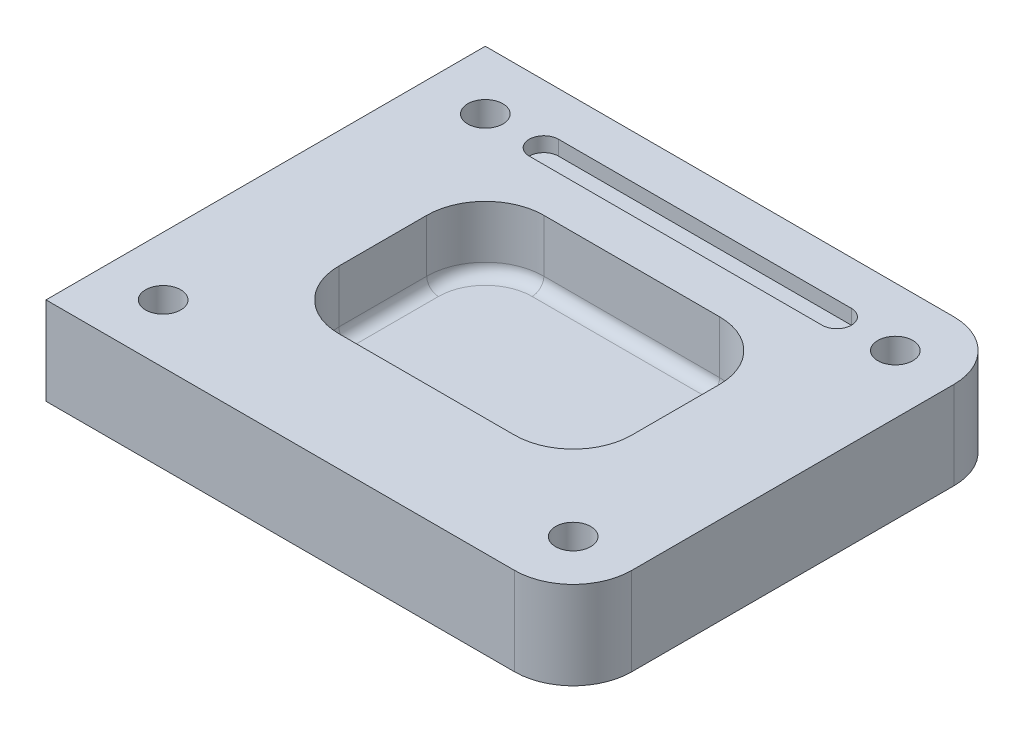
ISO-10303-21;
HEADER;
FILE_DESCRIPTION(('STEP AP214'),'2;1');
FILE_NAME('part.step','',(''),(''),'','','');
FILE_SCHEMA(('AUTOMOTIVE_DESIGN { 1 0 10303 214 1 1 1 1 }'));
ENDSEC;
DATA;
#1=APPLICATION_CONTEXT('core data for automotive mechanical design processes');
#2=APPLICATION_PROTOCOL_DEFINITION('international standard','automotive_design',2000,#1);
#3=PRODUCT_CONTEXT('',#1,'mechanical');
#4=PRODUCT('Part','Part','',(#3));
#5=PRODUCT_RELATED_PRODUCT_CATEGORY('part','',(#4));
#6=PRODUCT_DEFINITION_FORMATION('','',#4);
#7=PRODUCT_DEFINITION_CONTEXT('part definition',#1,'design');
#8=PRODUCT_DEFINITION('design','',#6,#7);
#9=PRODUCT_DEFINITION_SHAPE('','',#8);
#10=(LENGTH_UNIT() NAMED_UNIT(*) SI_UNIT(.MILLI.,.METRE.));
#11=(NAMED_UNIT(*) PLANE_ANGLE_UNIT() SI_UNIT($,.RADIAN.));
#12=(NAMED_UNIT(*) SI_UNIT($,.STERADIAN.) SOLID_ANGLE_UNIT());
#13=UNCERTAINTY_MEASURE_WITH_UNIT(LENGTH_MEASURE(1.E-05),#10,'distance_accuracy_value','');
#14=(GEOMETRIC_REPRESENTATION_CONTEXT(3) GLOBAL_UNCERTAINTY_ASSIGNED_CONTEXT((#13)) GLOBAL_UNIT_ASSIGNED_CONTEXT((#10,
#11,#12)) REPRESENTATION_CONTEXT('',''));
#15=CARTESIAN_POINT('',(0.,0.,0.));
#16=DIRECTION('',(0.,0.,1.));
#17=DIRECTION('',(1.,0.,0.));
#18=AXIS2_PLACEMENT_3D('',#15,#16,#17);
#19=CARTESIAN_POINT('',(90.,30.,75.));
#20=DIRECTION('',(-1.,0.,0.));
#21=DIRECTION('',(0.,0.,1.));
#22=AXIS2_PLACEMENT_3D('',#19,#20,#21);
#23=PLANE('',#22);
#24=DIRECTION('',(0.,0.,-1.));
#25=VECTOR('',#24,1.);
#26=CARTESIAN_POINT('',(90.,30.,75.));
#27=LINE('',#26,#25);
#28=CARTESIAN_POINT('',(90.,30.,55.));
#29=VERTEX_POINT('',#28);
#30=CARTESIAN_POINT('',(90.,30.,-55.));
#31=VERTEX_POINT('',#30);
#32=EDGE_CURVE('E309',#29,#31,#27,.T.);
#33=ORIENTED_EDGE('',*,*,#32,.F.);
#34=DIRECTION('',(0.,-1.,0.));
#35=VECTOR('',#34,1.);
#36=CARTESIAN_POINT('',(90.,30.,55.));
#37=LINE('',#36,#35);
#38=CARTESIAN_POINT('',(90.,0.,55.));
#39=VERTEX_POINT('',#38);
#40=EDGE_CURVE('E386',#29,#39,#37,.T.);
#41=ORIENTED_EDGE('',*,*,#40,.T.);
#42=DIRECTION('',(0.,0.,-1.));
#43=VECTOR('',#42,1.);
#44=CARTESIAN_POINT('',(90.,0.,75.));
#45=LINE('',#44,#43);
#46=CARTESIAN_POINT('',(90.,0.,-55.));
#47=VERTEX_POINT('',#46);
#48=EDGE_CURVE('E308',#39,#47,#45,.T.);
#49=ORIENTED_EDGE('',*,*,#48,.T.);
#50=DIRECTION('',(0.,-1.,0.));
#51=VECTOR('',#50,1.);
#52=CARTESIAN_POINT('',(90.,30.,-55.));
#53=LINE('',#52,#51);
#54=EDGE_CURVE('E383',#47,#31,#53,.F.);
#55=ORIENTED_EDGE('',*,*,#54,.T.);
#56=EDGE_LOOP('',(#33,#41,#49,#55));
#57=FACE_BOUND('',#56,.T.);
#58=ADVANCED_FACE('F43',(#57),#23,.F.);
#59=CARTESIAN_POINT('',(-90.,30.,-75.));
#60=DIRECTION('',(0.,0.,1.));
#61=DIRECTION('',(1.,0.,0.));
#62=AXIS2_PLACEMENT_3D('',#59,#60,#61);
#63=PLANE('',#62);
#64=DIRECTION('',(-1.,0.,0.));
#65=VECTOR('',#64,1.);
#66=CARTESIAN_POINT('',(-90.,30.,-75.));
#67=LINE('',#66,#65);
#68=CARTESIAN_POINT('',(70.,30.,-75.));
#69=VERTEX_POINT('',#68);
#70=CARTESIAN_POINT('',(-90.,30.,-75.));
#71=VERTEX_POINT('',#70);
#72=EDGE_CURVE('E313',#69,#71,#67,.T.);
#73=ORIENTED_EDGE('',*,*,#72,.F.);
#74=DIRECTION('',(0.,-1.,0.));
#75=VECTOR('',#74,1.);
#76=CARTESIAN_POINT('',(70.,30.,-75.));
#77=LINE('',#76,#75);
#78=CARTESIAN_POINT('',(70.,0.,-75.));
#79=VERTEX_POINT('',#78);
#80=EDGE_CURVE('E405',#69,#79,#77,.T.);
#81=ORIENTED_EDGE('',*,*,#80,.T.);
#82=DIRECTION('',(-1.,0.,0.));
#83=VECTOR('',#82,1.);
#84=CARTESIAN_POINT('',(-90.,0.,-75.));
#85=LINE('',#84,#83);
#86=CARTESIAN_POINT('',(-90.,0.,-75.));
#87=VERTEX_POINT('',#86);
#88=EDGE_CURVE('E328',#79,#87,#85,.T.);
#89=ORIENTED_EDGE('',*,*,#88,.T.);
#90=DIRECTION('',(0.,-1.,0.));
#91=VECTOR('',#90,1.);
#92=CARTESIAN_POINT('',(-90.,30.,-75.));
#93=LINE('',#92,#91);
#94=EDGE_CURVE('E340',#71,#87,#93,.T.);
#95=ORIENTED_EDGE('',*,*,#94,.F.);
#96=EDGE_LOOP('',(#73,#81,#89,#95));
#97=FACE_BOUND('',#96,.T.);
#98=ADVANCED_FACE('F560',(#97),#63,.F.);
#99=CARTESIAN_POINT('',(-90.,30.,75.));
#100=DIRECTION('',(1.,0.,0.));
#101=DIRECTION('',(0.,0.,-1.));
#102=AXIS2_PLACEMENT_3D('',#99,#100,#101);
#103=PLANE('',#102);
#104=DIRECTION('',(0.,0.,1.));
#105=VECTOR('',#104,1.);
#106=CARTESIAN_POINT('',(-90.,0.,75.));
#107=LINE('',#106,#105);
#108=CARTESIAN_POINT('',(-90.,0.,75.));
#109=VERTEX_POINT('',#108);
#110=EDGE_CURVE('E331',#87,#109,#107,.T.);
#111=ORIENTED_EDGE('',*,*,#110,.T.);
#112=DIRECTION('',(0.,-1.,0.));
#113=VECTOR('',#112,1.);
#114=CARTESIAN_POINT('',(-90.,30.,75.));
#115=LINE('',#114,#113);
#116=CARTESIAN_POINT('',(-90.,30.,75.));
#117=VERTEX_POINT('',#116);
#118=EDGE_CURVE('E324',#117,#109,#115,.T.);
#119=ORIENTED_EDGE('',*,*,#118,.F.);
#120=DIRECTION('',(0.,0.,1.));
#121=VECTOR('',#120,1.);
#122=CARTESIAN_POINT('',(-90.,30.,75.));
#123=LINE('',#122,#121);
#124=EDGE_CURVE('E317',#71,#117,#123,.T.);
#125=ORIENTED_EDGE('',*,*,#124,.F.);
#126=ORIENTED_EDGE('',*,*,#94,.T.);
#127=EDGE_LOOP('',(#111,#119,#125,#126));
#128=FACE_BOUND('',#127,.T.);
#129=ADVANCED_FACE('F566',(#128),#103,.F.);
#130=CARTESIAN_POINT('',(-90.,30.,75.));
#131=DIRECTION('',(0.,0.,-1.));
#132=DIRECTION('',(-1.,0.,0.));
#133=AXIS2_PLACEMENT_3D('',#130,#131,#132);
#134=PLANE('',#133);
#135=DIRECTION('',(1.,0.,0.));
#136=VECTOR('',#135,1.);
#137=CARTESIAN_POINT('',(-90.,0.,75.));
#138=LINE('',#137,#136);
#139=CARTESIAN_POINT('',(70.,0.,75.));
#140=VERTEX_POINT('',#139);
#141=EDGE_CURVE('E314',#109,#140,#138,.T.);
#142=ORIENTED_EDGE('',*,*,#141,.T.);
#143=DIRECTION('',(0.,-1.,0.));
#144=VECTOR('',#143,1.);
#145=CARTESIAN_POINT('',(70.,30.,75.));
#146=LINE('',#145,#144);
#147=CARTESIAN_POINT('',(70.,30.,75.));
#148=VERTEX_POINT('',#147);
#149=EDGE_CURVE('E396',#140,#148,#146,.F.);
#150=ORIENTED_EDGE('',*,*,#149,.T.);
#151=DIRECTION('',(1.,0.,0.));
#152=VECTOR('',#151,1.);
#153=CARTESIAN_POINT('',(-90.,30.,75.));
#154=LINE('',#153,#152);
#155=EDGE_CURVE('E320',#117,#148,#154,.T.);
#156=ORIENTED_EDGE('',*,*,#155,.F.);
#157=ORIENTED_EDGE('',*,*,#118,.T.);
#158=EDGE_LOOP('',(#142,#150,#156,#157));
#159=FACE_BOUND('',#158,.T.);
#160=ADVANCED_FACE('F767',(#159),#134,.F.);
#161=CARTESIAN_POINT('',(0.,30.,0.));
#162=DIRECTION('',(0.,-1.,0.));
#163=DIRECTION('',(0.,0.,-1.));
#164=AXIS2_PLACEMENT_3D('',#161,#162,#163);
#165=PLANE('',#164);
#166=DIRECTION('',(1.,0.,0.));
#167=VECTOR('',#166,1.);
#168=CARTESIAN_POINT('',(-50.,30.,-50.));
#169=LINE('',#168,#167);
#170=CARTESIAN_POINT('',(-50.,30.,-50.));
#171=VERTEX_POINT('',#170);
#172=CARTESIAN_POINT('',(50.,30.,-50.));
#173=VERTEX_POINT('',#172);
#174=EDGE_CURVE('E246',#171,#173,#169,.T.);
#175=ORIENTED_EDGE('',*,*,#174,.F.);
#176=CARTESIAN_POINT('',(-50.,30.,-55.));
#177=DIRECTION('',(0.,1.,0.));
#178=DIRECTION('',(0.,0.,1.));
#179=AXIS2_PLACEMENT_3D('',#176,#177,#178);
#180=CIRCLE('',#179,5.);
#181=CARTESIAN_POINT('',(-50.,30.,-60.));
#182=VERTEX_POINT('',#181);
#183=EDGE_CURVE('E213',#182,#171,#180,.T.);
#184=ORIENTED_EDGE('',*,*,#183,.F.);
#185=DIRECTION('',(-1.,0.,0.));
#186=VECTOR('',#185,1.);
#187=CARTESIAN_POINT('',(-50.,30.,-60.));
#188=LINE('',#187,#186);
#189=CARTESIAN_POINT('',(50.,30.,-60.));
#190=VERTEX_POINT('',#189);
#191=EDGE_CURVE('E233',#190,#182,#188,.T.);
#192=ORIENTED_EDGE('',*,*,#191,.F.);
#193=CARTESIAN_POINT('',(50.,30.,-55.));
#194=DIRECTION('',(0.,1.,0.));
#195=DIRECTION('',(0.,0.,1.));
#196=AXIS2_PLACEMENT_3D('',#193,#194,#195);
#197=CIRCLE('',#196,5.);
#198=EDGE_CURVE('E237',#173,#190,#197,.T.);
#199=ORIENTED_EDGE('',*,*,#198,.F.);
#200=EDGE_LOOP('',(#175,#184,#192,#199));
#201=FACE_BOUND('',#200,.T.);
#202=DIRECTION('',(-1.,0.,0.));
#203=VECTOR('',#202,1.);
#204=CARTESIAN_POINT('',(50.,30.,-35.));
#205=LINE('',#204,#203);
#206=CARTESIAN_POINT('',(30.,30.,-35.));
#207=VERTEX_POINT('',#206);
#208=CARTESIAN_POINT('',(-29.9999999999999,30.,-35.));
#209=VERTEX_POINT('',#208);
#210=EDGE_CURVE('E266',#207,#209,#205,.T.);
#211=ORIENTED_EDGE('',*,*,#210,.F.);
#212=CARTESIAN_POINT('',(30.,30.,-15.));
#213=DIRECTION('',(0.,-1.,0.));
#214=DIRECTION('',(0.,0.,-1.));
#215=AXIS2_PLACEMENT_3D('',#212,#213,#214);
#216=CIRCLE('',#215,20.);
#217=CARTESIAN_POINT('',(50.,30.,-15.));
#218=VERTEX_POINT('',#217);
#219=EDGE_CURVE('E377',#207,#218,#216,.T.);
#220=ORIENTED_EDGE('',*,*,#219,.T.);
#221=DIRECTION('',(0.,0.,-1.));
#222=VECTOR('',#221,1.);
#223=CARTESIAN_POINT('',(50.,30.,35.));
#224=LINE('',#223,#222);
#225=CARTESIAN_POINT('',(50.,30.,15.));
#226=VERTEX_POINT('',#225);
#227=EDGE_CURVE('E270',#226,#218,#224,.T.);
#228=ORIENTED_EDGE('',*,*,#227,.F.);
#229=CARTESIAN_POINT('',(30.,30.,15.));
#230=DIRECTION('',(0.,-1.,0.));
#231=DIRECTION('',(0.,0.,-1.));
#232=AXIS2_PLACEMENT_3D('',#229,#230,#231);
#233=CIRCLE('',#232,20.);
#234=CARTESIAN_POINT('',(30.,30.,35.));
#235=VERTEX_POINT('',#234);
#236=EDGE_CURVE('E371',#226,#235,#233,.T.);
#237=ORIENTED_EDGE('',*,*,#236,.T.);
#238=DIRECTION('',(1.,0.,0.));
#239=VECTOR('',#238,1.);
#240=CARTESIAN_POINT('',(-50.,30.,35.));
#241=LINE('',#240,#239);
#242=CARTESIAN_POINT('',(-30.,30.,35.));
#243=VERTEX_POINT('',#242);
#244=EDGE_CURVE('E255',#243,#235,#241,.T.);
#245=ORIENTED_EDGE('',*,*,#244,.F.);
#246=CARTESIAN_POINT('',(-30.,30.,15.));
#247=DIRECTION('',(0.,-1.,0.));
#248=DIRECTION('',(0.,0.,-1.));
#249=AXIS2_PLACEMENT_3D('',#246,#247,#248);
#250=CIRCLE('',#249,20.);
#251=CARTESIAN_POINT('',(-50.,30.,15.));
#252=VERTEX_POINT('',#251);
#253=EDGE_CURVE('E374',#243,#252,#250,.T.);
#254=ORIENTED_EDGE('',*,*,#253,.T.);
#255=DIRECTION('',(0.,0.,1.));
#256=VECTOR('',#255,1.);
#257=CARTESIAN_POINT('',(-50.,30.,-35.));
#258=LINE('',#257,#256);
#259=CARTESIAN_POINT('',(-50.,30.,-15.));
#260=VERTEX_POINT('',#259);
#261=EDGE_CURVE('E261',#260,#252,#258,.T.);
#262=ORIENTED_EDGE('',*,*,#261,.F.);
#263=CARTESIAN_POINT('',(-30.,30.,-15.));
#264=DIRECTION('',(0.,-1.,0.));
#265=DIRECTION('',(0.,0.,-1.));
#266=AXIS2_PLACEMENT_3D('',#263,#264,#265);
#267=CIRCLE('',#266,20.);
#268=EDGE_CURVE('E380',#260,#209,#267,.T.);
#269=ORIENTED_EDGE('',*,*,#268,.T.);
#270=EDGE_LOOP('',(#211,#220,#228,#237,#245,#254,#262,#269));
#271=FACE_BOUND('',#270,.T.);
#272=CARTESIAN_POINT('',(-70.,30.,55.));
#273=DIRECTION('',(0.,1.,0.));
#274=DIRECTION('',(0.,0.,1.));
#275=AXIS2_PLACEMENT_3D('',#272,#273,#274);
#276=CIRCLE('',#275,5.99999999999999);
#277=CARTESIAN_POINT('',(-70.,30.,61.));
#278=VERTEX_POINT('',#277);
#279=EDGE_CURVE('E265',#278,#278,#276,.T.);
#280=ORIENTED_EDGE('',*,*,#279,.F.);
#281=EDGE_LOOP('',(#280));
#282=FACE_BOUND('',#281,.T.);
#283=CARTESIAN_POINT('',(-70.,30.,-55.));
#284=DIRECTION('',(0.,1.,0.));
#285=DIRECTION('',(0.,0.,1.));
#286=AXIS2_PLACEMENT_3D('',#283,#284,#285);
#287=CIRCLE('',#286,5.99999999999999);
#288=CARTESIAN_POINT('',(-70.,30.,-49.));
#289=VERTEX_POINT('',#288);
#290=EDGE_CURVE('E284',#289,#289,#287,.T.);
#291=ORIENTED_EDGE('',*,*,#290,.F.);
#292=EDGE_LOOP('',(#291));
#293=FACE_BOUND('',#292,.T.);
#294=CARTESIAN_POINT('',(70.,30.,-55.));
#295=DIRECTION('',(0.,1.,0.));
#296=DIRECTION('',(0.,0.,1.));
#297=AXIS2_PLACEMENT_3D('',#294,#295,#296);
#298=CIRCLE('',#297,5.99999999999999);
#299=CARTESIAN_POINT('',(70.,30.,-49.));
#300=VERTEX_POINT('',#299);
#301=EDGE_CURVE('E292',#300,#300,#298,.T.);
#302=ORIENTED_EDGE('',*,*,#301,.F.);
#303=EDGE_LOOP('',(#302));
#304=FACE_BOUND('',#303,.T.);
#305=CARTESIAN_POINT('',(70.,30.,55.));
#306=DIRECTION('',(0.,1.,0.));
#307=DIRECTION('',(0.,0.,1.));
#308=AXIS2_PLACEMENT_3D('',#305,#306,#307);
#309=CIRCLE('',#308,5.99999999999999);
#310=CARTESIAN_POINT('',(70.,30.,61.));
#311=VERTEX_POINT('',#310);
#312=EDGE_CURVE('E300',#311,#311,#309,.T.);
#313=ORIENTED_EDGE('',*,*,#312,.F.);
#314=EDGE_LOOP('',(#313));
#315=FACE_BOUND('',#314,.T.);
#316=ORIENTED_EDGE('',*,*,#155,.T.);
#317=CARTESIAN_POINT('',(70.,30.,55.));
#318=DIRECTION('',(0.,-1.,0.));
#319=DIRECTION('',(0.,0.,-1.));
#320=AXIS2_PLACEMENT_3D('',#317,#318,#319);
#321=CIRCLE('',#320,20.);
#322=EDGE_CURVE('E402',#148,#29,#321,.F.);
#323=ORIENTED_EDGE('',*,*,#322,.T.);
#324=ORIENTED_EDGE('',*,*,#32,.T.);
#325=CARTESIAN_POINT('',(70.,30.,-55.));
#326=DIRECTION('',(0.,-1.,0.));
#327=DIRECTION('',(0.,0.,-1.));
#328=AXIS2_PLACEMENT_3D('',#325,#326,#327);
#329=CIRCLE('',#328,20.);
#330=EDGE_CURVE('E399',#31,#69,#329,.F.);
#331=ORIENTED_EDGE('',*,*,#330,.T.);
#332=ORIENTED_EDGE('',*,*,#72,.T.);
#333=ORIENTED_EDGE('',*,*,#124,.T.);
#334=EDGE_LOOP('',(#316,#323,#324,#331,#332,#333));
#335=FACE_BOUND('',#334,.T.);
#336=ADVANCED_FACE('F506',(#201,#271,#282,#293,#304,#315,#335),#165,.F.);
#337=CARTESIAN_POINT('',(0.,0.,0.));
#338=DIRECTION('',(0.,-1.,0.));
#339=DIRECTION('',(0.,0.,-1.));
#340=AXIS2_PLACEMENT_3D('',#337,#338,#339);
#341=PLANE('',#340);
#342=ORIENTED_EDGE('',*,*,#48,.F.);
#343=CARTESIAN_POINT('',(70.,0.,55.));
#344=DIRECTION('',(0.,-1.,0.));
#345=DIRECTION('',(0.,0.,-1.));
#346=AXIS2_PLACEMENT_3D('',#343,#344,#345);
#347=CIRCLE('',#346,20.);
#348=EDGE_CURVE('E393',#39,#140,#347,.T.);
#349=ORIENTED_EDGE('',*,*,#348,.T.);
#350=ORIENTED_EDGE('',*,*,#141,.F.);
#351=ORIENTED_EDGE('',*,*,#110,.F.);
#352=ORIENTED_EDGE('',*,*,#88,.F.);
#353=CARTESIAN_POINT('',(70.,0.,-55.));
#354=DIRECTION('',(0.,-1.,0.));
#355=DIRECTION('',(0.,0.,-1.));
#356=AXIS2_PLACEMENT_3D('',#353,#354,#355);
#357=CIRCLE('',#356,20.);
#358=EDGE_CURVE('E390',#79,#47,#357,.T.);
#359=ORIENTED_EDGE('',*,*,#358,.T.);
#360=EDGE_LOOP('',(#342,#349,#350,#351,#352,#359));
#361=FACE_BOUND('',#360,.T.);
#362=ADVANCED_FACE('F756',(#361),#341,.T.);
#363=CARTESIAN_POINT('',(70.,20.,55.));
#364=DIRECTION('',(0.,1.,0.));
#365=DIRECTION('',(0.,0.,1.));
#366=AXIS2_PLACEMENT_3D('',#363,#364,#365);
#367=CONICAL_SURFACE('',#366,5.99999999999999,1.02974425867665);
#368=CARTESIAN_POINT('',(70.,16.3948362858346,55.));
#369=VERTEX_POINT('',#368);
#370=VERTEX_LOOP('',#369);
#371=FACE_BOUND('',#370,.T.);
#372=CARTESIAN_POINT('',(70.,20.,55.));
#373=DIRECTION('',(0.,1.,0.));
#374=DIRECTION('',(0.,0.,1.));
#375=AXIS2_PLACEMENT_3D('',#372,#373,#374);
#376=CIRCLE('',#375,5.99999999999999);
#377=CARTESIAN_POINT('',(70.,20.,61.));
#378=VERTEX_POINT('',#377);
#379=EDGE_CURVE('E304',#378,#378,#376,.T.);
#380=ORIENTED_EDGE('',*,*,#379,.T.);
#381=EDGE_LOOP('',(#380));
#382=FACE_BOUND('',#381,.T.);
#383=ADVANCED_FACE('F779',(#371,#382),#367,.F.);
#384=CARTESIAN_POINT('',(70.,30.,55.));
#385=DIRECTION('',(0.,1.,0.));
#386=DIRECTION('',(0.,0.,1.));
#387=AXIS2_PLACEMENT_3D('',#384,#385,#386);
#388=CYLINDRICAL_SURFACE('',#387,5.99999999999999);
#389=ORIENTED_EDGE('',*,*,#379,.F.);
#390=EDGE_LOOP('',(#389));
#391=FACE_BOUND('',#390,.T.);
#392=ORIENTED_EDGE('',*,*,#312,.T.);
#393=EDGE_LOOP('',(#392));
#394=FACE_BOUND('',#393,.T.);
#395=ADVANCED_FACE('F785',(#391,#394),#388,.F.);
#396=CARTESIAN_POINT('',(70.,20.,-55.));
#397=DIRECTION('',(0.,1.,0.));
#398=DIRECTION('',(0.,0.,1.));
#399=AXIS2_PLACEMENT_3D('',#396,#397,#398);
#400=CONICAL_SURFACE('',#399,5.99999999999999,1.02974425867665);
#401=CARTESIAN_POINT('',(70.,16.3948362858346,-55.));
#402=VERTEX_POINT('',#401);
#403=VERTEX_LOOP('',#402);
#404=FACE_BOUND('',#403,.T.);
#405=CARTESIAN_POINT('',(70.,20.,-55.));
#406=DIRECTION('',(0.,1.,0.));
#407=DIRECTION('',(0.,0.,1.));
#408=AXIS2_PLACEMENT_3D('',#405,#406,#407);
#409=CIRCLE('',#408,5.99999999999999);
#410=CARTESIAN_POINT('',(70.,20.,-49.));
#411=VERTEX_POINT('',#410);
#412=EDGE_CURVE('E296',#411,#411,#409,.T.);
#413=ORIENTED_EDGE('',*,*,#412,.T.);
#414=EDGE_LOOP('',(#413));
#415=FACE_BOUND('',#414,.T.);
#416=ADVANCED_FACE('F794',(#404,#415),#400,.F.);
#417=CARTESIAN_POINT('',(70.,30.,-55.));
#418=DIRECTION('',(0.,1.,0.));
#419=DIRECTION('',(0.,0.,1.));
#420=AXIS2_PLACEMENT_3D('',#417,#418,#419);
#421=CYLINDRICAL_SURFACE('',#420,5.99999999999999);
#422=ORIENTED_EDGE('',*,*,#412,.F.);
#423=EDGE_LOOP('',(#422));
#424=FACE_BOUND('',#423,.T.);
#425=ORIENTED_EDGE('',*,*,#301,.T.);
#426=EDGE_LOOP('',(#425));
#427=FACE_BOUND('',#426,.T.);
#428=ADVANCED_FACE('F803',(#424,#427),#421,.F.);
#429=CARTESIAN_POINT('',(-70.,20.,-55.));
#430=DIRECTION('',(0.,1.,0.));
#431=DIRECTION('',(0.,0.,1.));
#432=AXIS2_PLACEMENT_3D('',#429,#430,#431);
#433=CONICAL_SURFACE('',#432,5.99999999999999,1.02974425867665);
#434=CARTESIAN_POINT('',(-70.,16.3948362858346,-55.));
#435=VERTEX_POINT('',#434);
#436=VERTEX_LOOP('',#435);
#437=FACE_BOUND('',#436,.T.);
#438=CARTESIAN_POINT('',(-70.,20.,-55.));
#439=DIRECTION('',(0.,1.,0.));
#440=DIRECTION('',(0.,0.,1.));
#441=AXIS2_PLACEMENT_3D('',#438,#439,#440);
#442=CIRCLE('',#441,5.99999999999999);
#443=CARTESIAN_POINT('',(-70.,20.,-49.));
#444=VERTEX_POINT('',#443);
#445=EDGE_CURVE('E288',#444,#444,#442,.T.);
#446=ORIENTED_EDGE('',*,*,#445,.T.);
#447=EDGE_LOOP('',(#446));
#448=FACE_BOUND('',#447,.T.);
#449=ADVANCED_FACE('F811',(#437,#448),#433,.F.);
#450=CARTESIAN_POINT('',(-70.,30.,-55.));
#451=DIRECTION('',(0.,1.,0.));
#452=DIRECTION('',(0.,0.,1.));
#453=AXIS2_PLACEMENT_3D('',#450,#451,#452);
#454=CYLINDRICAL_SURFACE('',#453,5.99999999999999);
#455=ORIENTED_EDGE('',*,*,#445,.F.);
#456=EDGE_LOOP('',(#455));
#457=FACE_BOUND('',#456,.T.);
#458=ORIENTED_EDGE('',*,*,#290,.T.);
#459=EDGE_LOOP('',(#458));
#460=FACE_BOUND('',#459,.T.);
#461=ADVANCED_FACE('F818',(#457,#460),#454,.F.);
#462=CARTESIAN_POINT('',(-70.,20.,55.));
#463=DIRECTION('',(0.,1.,0.));
#464=DIRECTION('',(0.,0.,1.));
#465=AXIS2_PLACEMENT_3D('',#462,#463,#464);
#466=CONICAL_SURFACE('',#465,5.99999999999999,1.02974425867665);
#467=CARTESIAN_POINT('',(-70.,16.3948362858346,55.));
#468=VERTEX_POINT('',#467);
#469=VERTEX_LOOP('',#468);
#470=FACE_BOUND('',#469,.T.);
#471=CARTESIAN_POINT('',(-70.,20.,55.));
#472=DIRECTION('',(0.,1.,0.));
#473=DIRECTION('',(0.,0.,1.));
#474=AXIS2_PLACEMENT_3D('',#471,#472,#473);
#475=CIRCLE('',#474,5.99999999999999);
#476=CARTESIAN_POINT('',(-70.,20.,61.));
#477=VERTEX_POINT('',#476);
#478=EDGE_CURVE('E280',#477,#477,#475,.T.);
#479=ORIENTED_EDGE('',*,*,#478,.T.);
#480=EDGE_LOOP('',(#479));
#481=FACE_BOUND('',#480,.T.);
#482=ADVANCED_FACE('F826',(#470,#481),#466,.F.);
#483=CARTESIAN_POINT('',(-70.,30.,55.));
#484=DIRECTION('',(0.,1.,0.));
#485=DIRECTION('',(0.,0.,1.));
#486=AXIS2_PLACEMENT_3D('',#483,#484,#485);
#487=CYLINDRICAL_SURFACE('',#486,5.99999999999999);
#488=ORIENTED_EDGE('',*,*,#478,.F.);
#489=EDGE_LOOP('',(#488));
#490=FACE_BOUND('',#489,.T.);
#491=ORIENTED_EDGE('',*,*,#279,.T.);
#492=EDGE_LOOP('',(#491));
#493=FACE_BOUND('',#492,.T.);
#494=ADVANCED_FACE('F649',(#490,#493),#487,.F.);
#495=CARTESIAN_POINT('',(0.,8.,0.));
#496=DIRECTION('',(0.,-1.,0.));
#497=DIRECTION('',(0.,0.,-1.));
#498=AXIS2_PLACEMENT_3D('',#495,#496,#497);
#499=PLANE('',#498);
#500=CARTESIAN_POINT('',(-30.,8.,-15.));
#501=DIRECTION('',(0.,-1.,0.));
#502=DIRECTION('',(0.,0.,-1.));
#503=AXIS2_PLACEMENT_3D('',#500,#501,#502);
#504=CIRCLE('',#503,16.);
#505=CARTESIAN_POINT('',(-30.,8.,-31.));
#506=VERTEX_POINT('',#505);
#507=CARTESIAN_POINT('',(-46.,8.,-15.));
#508=VERTEX_POINT('',#507);
#509=EDGE_CURVE('E409',#506,#508,#504,.F.);
#510=ORIENTED_EDGE('',*,*,#509,.T.);
#511=DIRECTION('',(0.,0.,1.));
#512=VECTOR('',#511,1.);
#513=CARTESIAN_POINT('',(-46.,8.,15.));
#514=LINE('',#513,#512);
#515=CARTESIAN_POINT('',(-46.,8.,15.));
#516=VERTEX_POINT('',#515);
#517=EDGE_CURVE('E430',#508,#516,#514,.T.);
#518=ORIENTED_EDGE('',*,*,#517,.T.);
#519=CARTESIAN_POINT('',(-30.,8.,15.));
#520=DIRECTION('',(0.,-1.,0.));
#521=DIRECTION('',(0.,0.,-1.));
#522=AXIS2_PLACEMENT_3D('',#519,#520,#521);
#523=CIRCLE('',#522,16.);
#524=CARTESIAN_POINT('',(-30.,8.,31.));
#525=VERTEX_POINT('',#524);
#526=EDGE_CURVE('E427',#516,#525,#523,.F.);
#527=ORIENTED_EDGE('',*,*,#526,.T.);
#528=DIRECTION('',(1.,0.,0.));
#529=VECTOR('',#528,1.);
#530=CARTESIAN_POINT('',(30.,8.,31.));
#531=LINE('',#530,#529);
#532=CARTESIAN_POINT('',(30.,8.,31.));
#533=VERTEX_POINT('',#532);
#534=EDGE_CURVE('E424',#525,#533,#531,.T.);
#535=ORIENTED_EDGE('',*,*,#534,.T.);
#536=CARTESIAN_POINT('',(30.,8.,15.));
#537=DIRECTION('',(0.,-1.,0.));
#538=DIRECTION('',(0.,0.,-1.));
#539=AXIS2_PLACEMENT_3D('',#536,#537,#538);
#540=CIRCLE('',#539,16.);
#541=CARTESIAN_POINT('',(46.,8.,15.));
#542=VERTEX_POINT('',#541);
#543=EDGE_CURVE('E421',#533,#542,#540,.F.);
#544=ORIENTED_EDGE('',*,*,#543,.T.);
#545=DIRECTION('',(0.,0.,-1.));
#546=VECTOR('',#545,1.);
#547=CARTESIAN_POINT('',(46.,8.,-15.));
#548=LINE('',#547,#546);
#549=CARTESIAN_POINT('',(46.,8.,-15.));
#550=VERTEX_POINT('',#549);
#551=EDGE_CURVE('E418',#542,#550,#548,.T.);
#552=ORIENTED_EDGE('',*,*,#551,.T.);
#553=CARTESIAN_POINT('',(30.,8.,-15.));
#554=DIRECTION('',(0.,-1.,0.));
#555=DIRECTION('',(0.,0.,-1.));
#556=AXIS2_PLACEMENT_3D('',#553,#554,#555);
#557=CIRCLE('',#556,16.);
#558=CARTESIAN_POINT('',(30.,8.,-31.));
#559=VERTEX_POINT('',#558);
#560=EDGE_CURVE('E415',#550,#559,#557,.F.);
#561=ORIENTED_EDGE('',*,*,#560,.T.);
#562=DIRECTION('',(-1.,0.,0.));
#563=VECTOR('',#562,1.);
#564=CARTESIAN_POINT('',(-30.,8.,-31.));
#565=LINE('',#564,#563);
#566=EDGE_CURVE('E412',#559,#506,#565,.T.);
#567=ORIENTED_EDGE('',*,*,#566,.T.);
#568=EDGE_LOOP('',(#510,#518,#527,#535,#544,#552,#561,#567));
#569=FACE_BOUND('',#568,.T.);
#570=ADVANCED_FACE('F541',(#569),#499,.F.);
#571=CARTESIAN_POINT('',(50.,-122.065556157337,35.));
#572=DIRECTION('',(1.,0.,0.));
#573=DIRECTION('',(0.,0.,-1.));
#574=AXIS2_PLACEMENT_3D('',#571,#572,#573);
#575=PLANE('',#574);
#576=DIRECTION('',(0.,1.,0.));
#577=VECTOR('',#576,1.);
#578=CARTESIAN_POINT('',(50.,8.00000000000001,-15.));
#579=LINE('',#578,#577);
#580=CARTESIAN_POINT('',(50.,12.,-15.));
#581=VERTEX_POINT('',#580);
#582=EDGE_CURVE('E344',#218,#581,#579,.F.);
#583=ORIENTED_EDGE('',*,*,#582,.T.);
#584=DIRECTION('',(0.,0.,-1.));
#585=VECTOR('',#584,1.);
#586=CARTESIAN_POINT('',(50.,12.,15.));
#587=LINE('',#586,#585);
#588=CARTESIAN_POINT('',(50.,12.,15.));
#589=VERTEX_POINT('',#588);
#590=EDGE_CURVE('E447',#581,#589,#587,.F.);
#591=ORIENTED_EDGE('',*,*,#590,.T.);
#592=DIRECTION('',(0.,1.,0.));
#593=VECTOR('',#592,1.);
#594=CARTESIAN_POINT('',(50.,30.,15.));
#595=LINE('',#594,#593);
#596=EDGE_CURVE('E348',#589,#226,#595,.T.);
#597=ORIENTED_EDGE('',*,*,#596,.T.);
#598=ORIENTED_EDGE('',*,*,#227,.T.);
#599=EDGE_LOOP('',(#583,#591,#597,#598));
#600=FACE_BOUND('',#599,.T.);
#601=ADVANCED_FACE('F496',(#600),#575,.F.);
#602=CARTESIAN_POINT('',(50.,-122.065556157337,-35.));
#603=DIRECTION('',(0.,0.,-1.));
#604=DIRECTION('',(-1.,0.,0.));
#605=AXIS2_PLACEMENT_3D('',#602,#603,#604);
#606=PLANE('',#605);
#607=DIRECTION('',(0.,1.,0.));
#608=VECTOR('',#607,1.);
#609=CARTESIAN_POINT('',(-30.,8.00000000000001,-35.));
#610=LINE('',#609,#608);
#611=CARTESIAN_POINT('',(-30.,12.,-35.));
#612=VERTEX_POINT('',#611);
#613=EDGE_CURVE('E365',#209,#612,#610,.F.);
#614=ORIENTED_EDGE('',*,*,#613,.T.);
#615=DIRECTION('',(-1.,0.,0.));
#616=VECTOR('',#615,1.);
#617=CARTESIAN_POINT('',(30.,12.,-35.));
#618=LINE('',#617,#616);
#619=CARTESIAN_POINT('',(30.,12.,-35.));
#620=VERTEX_POINT('',#619);
#621=EDGE_CURVE('E53',#612,#620,#618,.F.);
#622=ORIENTED_EDGE('',*,*,#621,.T.);
#623=DIRECTION('',(0.,1.,0.));
#624=VECTOR('',#623,1.);
#625=CARTESIAN_POINT('',(30.,30.,-35.));
#626=LINE('',#625,#624);
#627=EDGE_CURVE('E368',#620,#207,#626,.T.);
#628=ORIENTED_EDGE('',*,*,#627,.T.);
#629=ORIENTED_EDGE('',*,*,#210,.T.);
#630=EDGE_LOOP('',(#614,#622,#628,#629));
#631=FACE_BOUND('',#630,.T.);
#632=ADVANCED_FACE('F511',(#631),#606,.F.);
#633=CARTESIAN_POINT('',(-50.,-122.065556157337,-35.));
#634=DIRECTION('',(-1.,0.,0.));
#635=DIRECTION('',(0.,0.,1.));
#636=AXIS2_PLACEMENT_3D('',#633,#634,#635);
#637=PLANE('',#636);
#638=DIRECTION('',(0.,1.,0.));
#639=VECTOR('',#638,1.);
#640=CARTESIAN_POINT('',(-50.,8.00000000000001,15.));
#641=LINE('',#640,#639);
#642=CARTESIAN_POINT('',(-50.,12.,15.));
#643=VERTEX_POINT('',#642);
#644=EDGE_CURVE('E361',#252,#643,#641,.F.);
#645=ORIENTED_EDGE('',*,*,#644,.T.);
#646=DIRECTION('',(0.,0.,1.));
#647=VECTOR('',#646,1.);
#648=CARTESIAN_POINT('',(-50.,12.,-15.));
#649=LINE('',#648,#647);
#650=CARTESIAN_POINT('',(-50.,12.,-15.));
#651=VERTEX_POINT('',#650);
#652=EDGE_CURVE('E434',#643,#651,#649,.F.);
#653=ORIENTED_EDGE('',*,*,#652,.T.);
#654=DIRECTION('',(0.,1.,0.));
#655=VECTOR('',#654,1.);
#656=CARTESIAN_POINT('',(-50.,30.,-15.));
#657=LINE('',#656,#655);
#658=EDGE_CURVE('E358',#651,#260,#657,.T.);
#659=ORIENTED_EDGE('',*,*,#658,.T.);
#660=ORIENTED_EDGE('',*,*,#261,.T.);
#661=EDGE_LOOP('',(#645,#653,#659,#660));
#662=FACE_BOUND('',#661,.T.);
#663=ADVANCED_FACE('F518',(#662),#637,.F.);
#664=CARTESIAN_POINT('',(-50.,-122.065556157337,35.));
#665=DIRECTION('',(0.,0.,1.));
#666=DIRECTION('',(1.,0.,0.));
#667=AXIS2_PLACEMENT_3D('',#664,#665,#666);
#668=PLANE('',#667);
#669=DIRECTION('',(0.,1.,0.));
#670=VECTOR('',#669,1.);
#671=CARTESIAN_POINT('',(30.,8.00000000000001,35.));
#672=LINE('',#671,#670);
#673=CARTESIAN_POINT('',(30.,12.,35.));
#674=VERTEX_POINT('',#673);
#675=EDGE_CURVE('E354',#235,#674,#672,.F.);
#676=ORIENTED_EDGE('',*,*,#675,.T.);
#677=DIRECTION('',(1.,0.,0.));
#678=VECTOR('',#677,1.);
#679=CARTESIAN_POINT('',(-30.,12.,35.));
#680=LINE('',#679,#678);
#681=CARTESIAN_POINT('',(-30.,12.,35.));
#682=VERTEX_POINT('',#681);
#683=EDGE_CURVE('E441',#674,#682,#680,.F.);
#684=ORIENTED_EDGE('',*,*,#683,.T.);
#685=DIRECTION('',(0.,1.,0.));
#686=VECTOR('',#685,1.);
#687=CARTESIAN_POINT('',(-30.,30.,35.));
#688=LINE('',#687,#686);
#689=EDGE_CURVE('E351',#682,#243,#688,.T.);
#690=ORIENTED_EDGE('',*,*,#689,.T.);
#691=ORIENTED_EDGE('',*,*,#244,.T.);
#692=EDGE_LOOP('',(#676,#684,#690,#691));
#693=FACE_BOUND('',#692,.T.);
#694=ADVANCED_FACE('F549',(#693),#668,.F.);
#695=CARTESIAN_POINT('',(30.,-122.065556157337,15.));
#696=DIRECTION('',(0.,-1.,0.));
#697=DIRECTION('',(0.,0.,-1.));
#698=AXIS2_PLACEMENT_3D('',#695,#696,#697);
#699=CYLINDRICAL_SURFACE('',#698,20.);
#700=ORIENTED_EDGE('',*,*,#596,.F.);
#701=CARTESIAN_POINT('',(30.,12.,15.));
#702=DIRECTION('',(0.,-1.,0.));
#703=DIRECTION('',(0.,0.,-1.));
#704=AXIS2_PLACEMENT_3D('',#701,#702,#703);
#705=CIRCLE('',#704,20.);
#706=EDGE_CURVE('E444',#589,#674,#705,.T.);
#707=ORIENTED_EDGE('',*,*,#706,.T.);
#708=ORIENTED_EDGE('',*,*,#675,.F.);
#709=ORIENTED_EDGE('',*,*,#236,.F.);
#710=EDGE_LOOP('',(#700,#707,#708,#709));
#711=FACE_BOUND('',#710,.T.);
#712=ADVANCED_FACE('F500',(#711),#699,.F.);
#713=CARTESIAN_POINT('',(-30.,-122.065556157337,15.));
#714=DIRECTION('',(0.,-1.,0.));
#715=DIRECTION('',(0.,0.,-1.));
#716=AXIS2_PLACEMENT_3D('',#713,#714,#715);
#717=CYLINDRICAL_SURFACE('',#716,20.);
#718=ORIENTED_EDGE('',*,*,#689,.F.);
#719=CARTESIAN_POINT('',(-30.,12.,15.));
#720=DIRECTION('',(0.,-1.,0.));
#721=DIRECTION('',(0.,0.,-1.));
#722=AXIS2_PLACEMENT_3D('',#719,#720,#721);
#723=CIRCLE('',#722,20.);
#724=EDGE_CURVE('E438',#682,#643,#723,.T.);
#725=ORIENTED_EDGE('',*,*,#724,.T.);
#726=ORIENTED_EDGE('',*,*,#644,.F.);
#727=ORIENTED_EDGE('',*,*,#253,.F.);
#728=EDGE_LOOP('',(#718,#725,#726,#727));
#729=FACE_BOUND('',#728,.T.);
#730=ADVANCED_FACE('F522',(#729),#717,.F.);
#731=CARTESIAN_POINT('',(30.,-122.065556157337,-15.));
#732=DIRECTION('',(0.,-1.,0.));
#733=DIRECTION('',(0.,0.,-1.));
#734=AXIS2_PLACEMENT_3D('',#731,#732,#733);
#735=CYLINDRICAL_SURFACE('',#734,20.);
#736=ORIENTED_EDGE('',*,*,#627,.F.);
#737=CARTESIAN_POINT('',(30.,12.,-15.));
#738=DIRECTION('',(0.,-1.,0.));
#739=DIRECTION('',(0.,0.,-1.));
#740=AXIS2_PLACEMENT_3D('',#737,#738,#739);
#741=CIRCLE('',#740,20.);
#742=EDGE_CURVE('E450',#620,#581,#741,.T.);
#743=ORIENTED_EDGE('',*,*,#742,.T.);
#744=ORIENTED_EDGE('',*,*,#582,.F.);
#745=ORIENTED_EDGE('',*,*,#219,.F.);
#746=EDGE_LOOP('',(#736,#743,#744,#745));
#747=FACE_BOUND('',#746,.T.);
#748=ADVANCED_FACE('F510',(#747),#735,.F.);
#749=CARTESIAN_POINT('',(-30.,-122.065556157337,-15.));
#750=DIRECTION('',(0.,-1.,0.));
#751=DIRECTION('',(0.,0.,-1.));
#752=AXIS2_PLACEMENT_3D('',#749,#750,#751);
#753=CYLINDRICAL_SURFACE('',#752,20.);
#754=ORIENTED_EDGE('',*,*,#658,.F.);
#755=CARTESIAN_POINT('',(-30.,12.,-15.));
#756=DIRECTION('',(0.,-1.,0.));
#757=DIRECTION('',(0.,0.,-1.));
#758=AXIS2_PLACEMENT_3D('',#755,#756,#757);
#759=CIRCLE('',#758,20.);
#760=EDGE_CURVE('E12',#651,#612,#759,.T.);
#761=ORIENTED_EDGE('',*,*,#760,.T.);
#762=ORIENTED_EDGE('',*,*,#613,.F.);
#763=ORIENTED_EDGE('',*,*,#268,.F.);
#764=EDGE_LOOP('',(#754,#761,#762,#763));
#765=FACE_BOUND('',#764,.T.);
#766=ADVANCED_FACE('F513',(#765),#753,.F.);
#767=CARTESIAN_POINT('',(70.,30.,55.));
#768=DIRECTION('',(0.,-1.,0.));
#769=DIRECTION('',(0.,0.,-1.));
#770=AXIS2_PLACEMENT_3D('',#767,#768,#769);
#771=CYLINDRICAL_SURFACE('',#770,20.);
#772=ORIENTED_EDGE('',*,*,#322,.F.);
#773=ORIENTED_EDGE('',*,*,#149,.F.);
#774=ORIENTED_EDGE('',*,*,#348,.F.);
#775=ORIENTED_EDGE('',*,*,#40,.F.);
#776=EDGE_LOOP('',(#772,#773,#774,#775));
#777=FACE_BOUND('',#776,.T.);
#778=ADVANCED_FACE('F578',(#777),#771,.T.);
#779=CARTESIAN_POINT('',(70.,30.,-55.));
#780=DIRECTION('',(0.,-1.,0.));
#781=DIRECTION('',(0.,0.,-1.));
#782=AXIS2_PLACEMENT_3D('',#779,#780,#781);
#783=CYLINDRICAL_SURFACE('',#782,20.);
#784=ORIENTED_EDGE('',*,*,#330,.F.);
#785=ORIENTED_EDGE('',*,*,#54,.F.);
#786=ORIENTED_EDGE('',*,*,#358,.F.);
#787=ORIENTED_EDGE('',*,*,#80,.F.);
#788=EDGE_LOOP('',(#784,#785,#786,#787));
#789=FACE_BOUND('',#788,.T.);
#790=ADVANCED_FACE('F581',(#789),#783,.T.);
#791=CARTESIAN_POINT('',(-50.,25.,-55.));
#792=DIRECTION('',(0.,1.,0.));
#793=DIRECTION('',(0.,0.,1.));
#794=AXIS2_PLACEMENT_3D('',#791,#792,#793);
#795=CYLINDRICAL_SURFACE('',#794,5.);
#796=ORIENTED_EDGE('',*,*,#183,.T.);
#797=DIRECTION('',(0.,1.,0.));
#798=VECTOR('',#797,1.);
#799=CARTESIAN_POINT('',(-50.,25.,-50.));
#800=LINE('',#799,#798);
#801=CARTESIAN_POINT('',(-50.,25.,-50.));
#802=VERTEX_POINT('',#801);
#803=EDGE_CURVE('E206',#802,#171,#800,.T.);
#804=ORIENTED_EDGE('',*,*,#803,.F.);
#805=CARTESIAN_POINT('',(-50.,25.,-55.));
#806=DIRECTION('',(0.,1.,0.));
#807=DIRECTION('',(0.,0.,1.));
#808=AXIS2_PLACEMENT_3D('',#805,#806,#807);
#809=CIRCLE('',#808,5.);
#810=CARTESIAN_POINT('',(-50.,25.,-60.));
#811=VERTEX_POINT('',#810);
#812=EDGE_CURVE('E210',#811,#802,#809,.T.);
#813=ORIENTED_EDGE('',*,*,#812,.F.);
#814=DIRECTION('',(0.,1.,0.));
#815=VECTOR('',#814,1.);
#816=CARTESIAN_POINT('',(-50.,25.,-60.));
#817=LINE('',#816,#815);
#818=EDGE_CURVE('E252',#811,#182,#817,.T.);
#819=ORIENTED_EDGE('',*,*,#818,.T.);
#820=EDGE_LOOP('',(#796,#804,#813,#819));
#821=FACE_BOUND('',#820,.T.);
#822=ADVANCED_FACE('F208',(#821),#795,.F.);
#823=CARTESIAN_POINT('',(-50.,25.,-60.));
#824=DIRECTION('',(0.,0.,-1.));
#825=DIRECTION('',(-1.,0.,0.));
#826=AXIS2_PLACEMENT_3D('',#823,#824,#825);
#827=PLANE('',#826);
#828=ORIENTED_EDGE('',*,*,#191,.T.);
#829=ORIENTED_EDGE('',*,*,#818,.F.);
#830=DIRECTION('',(-1.,0.,0.));
#831=VECTOR('',#830,1.);
#832=CARTESIAN_POINT('',(-50.,25.,-60.));
#833=LINE('',#832,#831);
#834=CARTESIAN_POINT('',(50.,25.,-60.));
#835=VERTEX_POINT('',#834);
#836=EDGE_CURVE('E219',#835,#811,#833,.T.);
#837=ORIENTED_EDGE('',*,*,#836,.F.);
#838=DIRECTION('',(0.,1.,0.));
#839=VECTOR('',#838,1.);
#840=CARTESIAN_POINT('',(50.,25.,-60.));
#841=LINE('',#840,#839);
#842=EDGE_CURVE('E256',#835,#190,#841,.T.);
#843=ORIENTED_EDGE('',*,*,#842,.T.);
#844=EDGE_LOOP('',(#828,#829,#837,#843));
#845=FACE_BOUND('',#844,.T.);
#846=ADVANCED_FACE('F611',(#845),#827,.F.);
#847=CARTESIAN_POINT('',(50.,25.,-55.));
#848=DIRECTION('',(0.,1.,0.));
#849=DIRECTION('',(0.,0.,1.));
#850=AXIS2_PLACEMENT_3D('',#847,#848,#849);
#851=CYLINDRICAL_SURFACE('',#850,5.);
#852=ORIENTED_EDGE('',*,*,#198,.T.);
#853=ORIENTED_EDGE('',*,*,#842,.F.);
#854=CARTESIAN_POINT('',(50.,25.,-55.));
#855=DIRECTION('',(0.,1.,0.));
#856=DIRECTION('',(0.,0.,1.));
#857=AXIS2_PLACEMENT_3D('',#854,#855,#856);
#858=CIRCLE('',#857,5.);
#859=CARTESIAN_POINT('',(50.,25.,-50.));
#860=VERTEX_POINT('',#859);
#861=EDGE_CURVE('E228',#860,#835,#858,.T.);
#862=ORIENTED_EDGE('',*,*,#861,.F.);
#863=DIRECTION('',(0.,1.,0.));
#864=VECTOR('',#863,1.);
#865=CARTESIAN_POINT('',(50.,25.,-50.));
#866=LINE('',#865,#864);
#867=EDGE_CURVE('E218',#860,#173,#866,.T.);
#868=ORIENTED_EDGE('',*,*,#867,.T.);
#869=EDGE_LOOP('',(#852,#853,#862,#868));
#870=FACE_BOUND('',#869,.T.);
#871=ADVANCED_FACE('F608',(#870),#851,.F.);
#872=CARTESIAN_POINT('',(-50.,25.,-50.));
#873=DIRECTION('',(0.,0.,1.));
#874=DIRECTION('',(1.,0.,0.));
#875=AXIS2_PLACEMENT_3D('',#872,#873,#874);
#876=PLANE('',#875);
#877=ORIENTED_EDGE('',*,*,#174,.T.);
#878=ORIENTED_EDGE('',*,*,#867,.F.);
#879=DIRECTION('',(1.,0.,0.));
#880=VECTOR('',#879,1.);
#881=CARTESIAN_POINT('',(-50.,25.,-50.));
#882=LINE('',#881,#880);
#883=EDGE_CURVE('E222',#802,#860,#882,.T.);
#884=ORIENTED_EDGE('',*,*,#883,.F.);
#885=ORIENTED_EDGE('',*,*,#803,.T.);
#886=EDGE_LOOP('',(#877,#878,#884,#885));
#887=FACE_BOUND('',#886,.T.);
#888=ADVANCED_FACE('F223',(#887),#876,.F.);
#889=CARTESIAN_POINT('',(-50.,25.,-55.));
#890=DIRECTION('',(0.,1.,0.));
#891=DIRECTION('',(0.,0.,1.));
#892=AXIS2_PLACEMENT_3D('',#889,#890,#891);
#893=PLANE('',#892);
#894=ORIENTED_EDGE('',*,*,#812,.T.);
#895=ORIENTED_EDGE('',*,*,#883,.T.);
#896=ORIENTED_EDGE('',*,*,#861,.T.);
#897=ORIENTED_EDGE('',*,*,#836,.T.);
#898=EDGE_LOOP('',(#894,#895,#896,#897));
#899=FACE_BOUND('',#898,.T.);
#900=ADVANCED_FACE('F230',(#899),#893,.T.);
#901=CARTESIAN_POINT('',(46.,12.,0.));
#902=DIRECTION('',(0.,0.,1.));
#903=DIRECTION('',(1.,0.,0.));
#904=AXIS2_PLACEMENT_3D('',#901,#902,#903);
#905=CYLINDRICAL_SURFACE('',#904,4.);
#906=CARTESIAN_POINT('',(46.,12.,15.));
#907=DIRECTION('',(0.,0.,-1.));
#908=DIRECTION('',(-1.,0.,0.));
#909=AXIS2_PLACEMENT_3D('',#906,#907,#908);
#910=CIRCLE('',#909,4.);
#911=EDGE_CURVE('E476',#589,#542,#910,.T.);
#912=ORIENTED_EDGE('',*,*,#911,.F.);
#913=ORIENTED_EDGE('',*,*,#590,.F.);
#914=CARTESIAN_POINT('',(46.,12.,-15.));
#915=DIRECTION('',(0.,0.,1.));
#916=DIRECTION('',(1.,0.,0.));
#917=AXIS2_PLACEMENT_3D('',#914,#915,#916);
#918=CIRCLE('',#917,4.);
#919=EDGE_CURVE('E47',#550,#581,#918,.T.);
#920=ORIENTED_EDGE('',*,*,#919,.F.);
#921=ORIENTED_EDGE('',*,*,#551,.F.);
#922=EDGE_LOOP('',(#912,#913,#920,#921));
#923=FACE_BOUND('',#922,.T.);
#924=ADVANCED_FACE('F45',(#923),#905,.F.);
#925=CARTESIAN_POINT('',(30.,12.,-15.));
#926=DIRECTION('',(0.,-1.,0.));
#927=DIRECTION('',(0.,0.,-1.));
#928=AXIS2_PLACEMENT_3D('',#925,#926,#927);
#929=TOROIDAL_SURFACE('',#928,16.,4.);
#930=ORIENTED_EDGE('',*,*,#919,.T.);
#931=ORIENTED_EDGE('',*,*,#742,.F.);
#932=CARTESIAN_POINT('',(30.,12.,-31.));
#933=DIRECTION('',(1.,0.,0.));
#934=DIRECTION('',(0.,0.,-1.));
#935=AXIS2_PLACEMENT_3D('',#932,#933,#934);
#936=CIRCLE('',#935,4.);
#937=EDGE_CURVE('E473',#559,#620,#936,.T.);
#938=ORIENTED_EDGE('',*,*,#937,.F.);
#939=ORIENTED_EDGE('',*,*,#560,.F.);
#940=EDGE_LOOP('',(#930,#931,#938,#939));
#941=FACE_BOUND('',#940,.T.);
#942=ADVANCED_FACE('F489',(#941),#929,.F.);
#943=CARTESIAN_POINT('',(30.,12.,15.));
#944=DIRECTION('',(0.,-1.,0.));
#945=DIRECTION('',(0.,0.,-1.));
#946=AXIS2_PLACEMENT_3D('',#943,#944,#945);
#947=TOROIDAL_SURFACE('',#946,16.,4.);
#948=ORIENTED_EDGE('',*,*,#911,.T.);
#949=ORIENTED_EDGE('',*,*,#543,.F.);
#950=CARTESIAN_POINT('',(30.,12.,31.));
#951=DIRECTION('',(1.,0.,0.));
#952=DIRECTION('',(0.,0.,-1.));
#953=AXIS2_PLACEMENT_3D('',#950,#951,#952);
#954=CIRCLE('',#953,4.);
#955=EDGE_CURVE('E469',#674,#533,#954,.T.);
#956=ORIENTED_EDGE('',*,*,#955,.F.);
#957=ORIENTED_EDGE('',*,*,#706,.F.);
#958=EDGE_LOOP('',(#948,#949,#956,#957));
#959=FACE_BOUND('',#958,.T.);
#960=ADVANCED_FACE('F544',(#959),#947,.F.);
#961=CARTESIAN_POINT('',(0.,12.,-31.));
#962=DIRECTION('',(1.,0.,0.));
#963=DIRECTION('',(0.,0.,-1.));
#964=AXIS2_PLACEMENT_3D('',#961,#962,#963);
#965=CYLINDRICAL_SURFACE('',#964,4.);
#966=ORIENTED_EDGE('',*,*,#937,.T.);
#967=ORIENTED_EDGE('',*,*,#621,.F.);
#968=CARTESIAN_POINT('',(-30.,12.,-31.));
#969=DIRECTION('',(1.,0.,0.));
#970=DIRECTION('',(0.,0.,-1.));
#971=AXIS2_PLACEMENT_3D('',#968,#969,#970);
#972=CIRCLE('',#971,4.);
#973=EDGE_CURVE('E465',#506,#612,#972,.T.);
#974=ORIENTED_EDGE('',*,*,#973,.F.);
#975=ORIENTED_EDGE('',*,*,#566,.F.);
#976=EDGE_LOOP('',(#966,#967,#974,#975));
#977=FACE_BOUND('',#976,.T.);
#978=ADVANCED_FACE('F539',(#977),#965,.F.);
#979=CARTESIAN_POINT('',(0.,12.,31.));
#980=DIRECTION('',(-1.,0.,0.));
#981=DIRECTION('',(0.,0.,1.));
#982=AXIS2_PLACEMENT_3D('',#979,#980,#981);
#983=CYLINDRICAL_SURFACE('',#982,4.);
#984=ORIENTED_EDGE('',*,*,#955,.T.);
#985=ORIENTED_EDGE('',*,*,#534,.F.);
#986=CARTESIAN_POINT('',(-30.,12.,31.));
#987=DIRECTION('',(1.,0.,0.));
#988=DIRECTION('',(0.,0.,-1.));
#989=AXIS2_PLACEMENT_3D('',#986,#987,#988);
#990=CIRCLE('',#989,4.);
#991=EDGE_CURVE('E461',#682,#525,#990,.T.);
#992=ORIENTED_EDGE('',*,*,#991,.F.);
#993=ORIENTED_EDGE('',*,*,#683,.F.);
#994=EDGE_LOOP('',(#984,#985,#992,#993));
#995=FACE_BOUND('',#994,.T.);
#996=ADVANCED_FACE('F547',(#995),#983,.F.);
#997=CARTESIAN_POINT('',(-30.,12.,-15.));
#998=DIRECTION('',(0.,-1.,0.));
#999=DIRECTION('',(0.,0.,-1.));
#1000=AXIS2_PLACEMENT_3D('',#997,#998,#999);
#1001=TOROIDAL_SURFACE('',#1000,16.,4.);
#1002=ORIENTED_EDGE('',*,*,#973,.T.);
#1003=ORIENTED_EDGE('',*,*,#760,.F.);
#1004=CARTESIAN_POINT('',(-46.,12.,-15.));
#1005=DIRECTION('',(0.,0.,-1.));
#1006=DIRECTION('',(-1.,0.,0.));
#1007=AXIS2_PLACEMENT_3D('',#1004,#1005,#1006);
#1008=CIRCLE('',#1007,4.);
#1009=EDGE_CURVE('E458',#508,#651,#1008,.T.);
#1010=ORIENTED_EDGE('',*,*,#1009,.F.);
#1011=ORIENTED_EDGE('',*,*,#509,.F.);
#1012=EDGE_LOOP('',(#1002,#1003,#1010,#1011));
#1013=FACE_BOUND('',#1012,.T.);
#1014=ADVANCED_FACE('F535',(#1013),#1001,.F.);
#1015=CARTESIAN_POINT('',(-30.,12.,15.));
#1016=DIRECTION('',(0.,-1.,0.));
#1017=DIRECTION('',(0.,0.,-1.));
#1018=AXIS2_PLACEMENT_3D('',#1015,#1016,#1017);
#1019=TOROIDAL_SURFACE('',#1018,16.,4.);
#1020=ORIENTED_EDGE('',*,*,#991,.T.);
#1021=ORIENTED_EDGE('',*,*,#526,.F.);
#1022=CARTESIAN_POINT('',(-46.,12.,15.));
#1023=DIRECTION('',(0.,0.,1.));
#1024=DIRECTION('',(1.,0.,0.));
#1025=AXIS2_PLACEMENT_3D('',#1022,#1023,#1024);
#1026=CIRCLE('',#1025,4.);
#1027=EDGE_CURVE('E455',#643,#516,#1026,.T.);
#1028=ORIENTED_EDGE('',*,*,#1027,.F.);
#1029=ORIENTED_EDGE('',*,*,#724,.F.);
#1030=EDGE_LOOP('',(#1020,#1021,#1028,#1029));
#1031=FACE_BOUND('',#1030,.T.);
#1032=ADVANCED_FACE('F527',(#1031),#1019,.F.);
#1033=CARTESIAN_POINT('',(-46.,12.,0.));
#1034=DIRECTION('',(0.,0.,-1.));
#1035=DIRECTION('',(-1.,0.,0.));
#1036=AXIS2_PLACEMENT_3D('',#1033,#1034,#1035);
#1037=CYLINDRICAL_SURFACE('',#1036,4.);
#1038=ORIENTED_EDGE('',*,*,#1009,.T.);
#1039=ORIENTED_EDGE('',*,*,#652,.F.);
#1040=ORIENTED_EDGE('',*,*,#1027,.T.);
#1041=ORIENTED_EDGE('',*,*,#517,.F.);
#1042=EDGE_LOOP('',(#1038,#1039,#1040,#1041));
#1043=FACE_BOUND('',#1042,.T.);
#1044=ADVANCED_FACE('F531',(#1043),#1037,.F.);
#1045=CLOSED_SHELL('',(#58,#98,#129,#160,#336,#362,#383,#395,#416,#428,#449,#461,#482,#494,#570,
#601,#632,#663,#694,#712,#730,#748,#766,#778,#790,#822,#846,#871,#888,#900,#924,#942,#960,#978,
#996,#1014,#1032,#1044));
#1046=MANIFOLD_SOLID_BREP('B2',#1045);
#1047=ADVANCED_BREP_SHAPE_REPRESENTATION('',(#18,#1046),#14);
#1048=SHAPE_DEFINITION_REPRESENTATION(#9,#1047);
ENDSEC;
END-ISO-10303-21;
